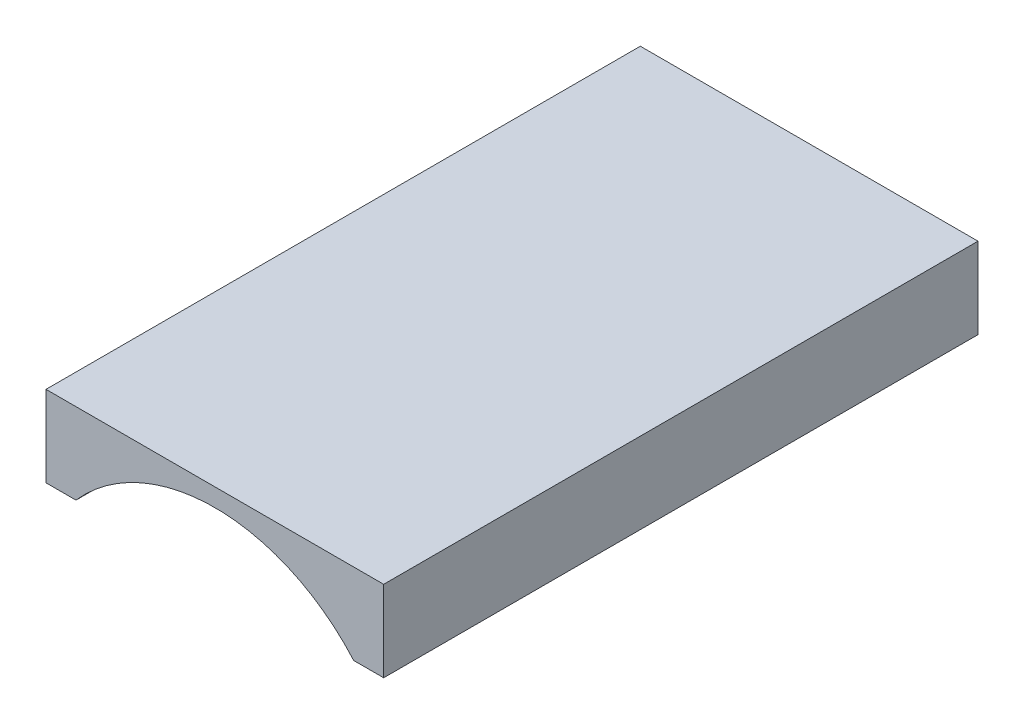
ISO-10303-21;
HEADER;
FILE_DESCRIPTION(('STEP AP214'),'2;1');
FILE_NAME('part.step','',(''),(''),'','','');
FILE_SCHEMA(('AUTOMOTIVE_DESIGN { 1 0 10303 214 1 1 1 1 }'));
ENDSEC;
DATA;
#1=APPLICATION_CONTEXT('core data for automotive mechanical design processes');
#2=APPLICATION_PROTOCOL_DEFINITION('international standard','automotive_design',2000,#1);
#3=PRODUCT_CONTEXT('',#1,'mechanical');
#4=PRODUCT('Part','Part','',(#3));
#5=PRODUCT_RELATED_PRODUCT_CATEGORY('part','',(#4));
#6=PRODUCT_DEFINITION_FORMATION('','',#4);
#7=PRODUCT_DEFINITION_CONTEXT('part definition',#1,'design');
#8=PRODUCT_DEFINITION('design','',#6,#7);
#9=PRODUCT_DEFINITION_SHAPE('','',#8);
#10=(LENGTH_UNIT() NAMED_UNIT(*) SI_UNIT(.MILLI.,.METRE.));
#11=(NAMED_UNIT(*) PLANE_ANGLE_UNIT() SI_UNIT($,.RADIAN.));
#12=(NAMED_UNIT(*) SI_UNIT($,.STERADIAN.) SOLID_ANGLE_UNIT());
#13=UNCERTAINTY_MEASURE_WITH_UNIT(LENGTH_MEASURE(1.E-05),#10,'distance_accuracy_value','');
#14=(GEOMETRIC_REPRESENTATION_CONTEXT(3) GLOBAL_UNCERTAINTY_ASSIGNED_CONTEXT((#13)) GLOBAL_UNIT_ASSIGNED_CONTEXT((#10,
#11,#12)) REPRESENTATION_CONTEXT('',''));
#15=CARTESIAN_POINT('',(0.,0.,0.));
#16=DIRECTION('',(0.,0.,1.));
#17=DIRECTION('',(1.,0.,0.));
#18=AXIS2_PLACEMENT_3D('',#15,#16,#17);
#19=CARTESIAN_POINT('',(42.9347751341225,21.3088495924748,-41.8253043034318));
#20=DIRECTION('',(0.,-1.,0.));
#21=DIRECTION('',(0.,0.,-1.));
#22=AXIS2_PLACEMENT_3D('',#19,#20,#21);
#23=PLANE('',#22);
#24=DIRECTION('',(0.,0.,1.));
#25=VECTOR('',#24,1.);
#26=CARTESIAN_POINT('',(56.6032433394389,21.3088495924748,-39.0500773181584));
#27=LINE('',#26,#25);
#28=CARTESIAN_POINT('',(56.6032433394389,21.3088495924748,-26.4));
#29=VERTEX_POINT('',#28);
#30=CARTESIAN_POINT('',(56.6032433394389,21.3088495924748,0.));
#31=VERTEX_POINT('',#30);
#32=EDGE_CURVE('E133',#29,#31,#27,.T.);
#33=ORIENTED_EDGE('',*,*,#32,.F.);
#34=DIRECTION('',(1.,0.,0.));
#35=VECTOR('',#34,1.);
#36=CARTESIAN_POINT('',(42.9347751341225,21.3088495924748,-26.4));
#37=LINE('',#36,#35);
#38=CARTESIAN_POINT('',(57.9347751341225,21.3088495924748,-26.4));
#39=VERTEX_POINT('',#38);
#40=EDGE_CURVE('E85',#29,#39,#37,.T.);
#41=ORIENTED_EDGE('',*,*,#40,.T.);
#42=DIRECTION('',(0.,0.,1.));
#43=VECTOR('',#42,1.);
#44=CARTESIAN_POINT('',(57.9347751341225,21.3088495924748,-41.8253043034318));
#45=LINE('',#44,#43);
#46=CARTESIAN_POINT('',(57.9347751341225,21.3088495924748,0.));
#47=VERTEX_POINT('',#46);
#48=EDGE_CURVE('E128',#39,#47,#45,.T.);
#49=ORIENTED_EDGE('',*,*,#48,.T.);
#50=DIRECTION('',(1.,0.,0.));
#51=VECTOR('',#50,1.);
#52=CARTESIAN_POINT('',(42.9347751341225,21.3088495924748,0.));
#53=LINE('',#52,#51);
#54=EDGE_CURVE('E112',#31,#47,#53,.T.);
#55=ORIENTED_EDGE('',*,*,#54,.F.);
#56=EDGE_LOOP('',(#33,#41,#49,#55));
#57=FACE_BOUND('',#56,.T.);
#58=ADVANCED_FACE('F34',(#57),#23,.T.);
#59=CARTESIAN_POINT('',(42.9347751341225,7.9,-26.4));
#60=DIRECTION('',(0.,0.,-1.));
#61=DIRECTION('',(-1.,0.,0.));
#62=AXIS2_PLACEMENT_3D('',#59,#60,#61);
#63=PLANE('',#62);
#64=CARTESIAN_POINT('',(50.4347751341225,15.9060725287787,-26.4));
#65=DIRECTION('',(0.,0.,-1.));
#66=DIRECTION('',(-1.,0.,0.));
#67=AXIS2_PLACEMENT_3D('',#64,#65,#66);
#68=CIRCLE('',#67,8.2);
#69=CARTESIAN_POINT('',(44.266306928806,21.3088495924748,-26.4));
#70=VERTEX_POINT('',#69);
#71=EDGE_CURVE('E136',#29,#70,#68,.F.);
#72=ORIENTED_EDGE('',*,*,#71,.T.);
#73=CARTESIAN_POINT('',(42.9347751341225,21.3088495924748,-26.4));
#74=VERTEX_POINT('',#73);
#75=EDGE_CURVE('E77',#74,#70,#37,.T.);
#76=ORIENTED_EDGE('',*,*,#75,.F.);
#77=DIRECTION('',(0.,-1.,0.));
#78=VECTOR('',#77,1.);
#79=CARTESIAN_POINT('',(42.9347751341225,24.9060725287787,-26.4));
#80=LINE('',#79,#78);
#81=CARTESIAN_POINT('',(42.9347751341225,24.9060725287787,-26.4));
#82=VERTEX_POINT('',#81);
#83=EDGE_CURVE('E42',#82,#74,#80,.T.);
#84=ORIENTED_EDGE('',*,*,#83,.F.);
#85=DIRECTION('',(-1.,0.,0.));
#86=VECTOR('',#85,1.);
#87=CARTESIAN_POINT('',(57.9347751341225,24.9060725287787,-26.4));
#88=LINE('',#87,#86);
#89=CARTESIAN_POINT('',(57.9347751341225,24.9060725287787,-26.4));
#90=VERTEX_POINT('',#89);
#91=EDGE_CURVE('E104',#90,#82,#88,.T.);
#92=ORIENTED_EDGE('',*,*,#91,.F.);
#93=DIRECTION('',(0.,1.,0.));
#94=VECTOR('',#93,1.);
#95=CARTESIAN_POINT('',(57.9347751341225,21.3088495924748,-26.4));
#96=LINE('',#95,#94);
#97=EDGE_CURVE('E100',#39,#90,#96,.T.);
#98=ORIENTED_EDGE('',*,*,#97,.F.);
#99=ORIENTED_EDGE('',*,*,#40,.F.);
#100=EDGE_LOOP('',(#72,#76,#84,#92,#98,#99));
#101=FACE_BOUND('',#100,.T.);
#102=ADVANCED_FACE('F36',(#101),#63,.T.);
#103=CARTESIAN_POINT('',(0.,0.,0.));
#104=DIRECTION('',(0.,0.,1.));
#105=DIRECTION('',(1.,0.,0.));
#106=AXIS2_PLACEMENT_3D('',#103,#104,#105);
#107=PLANE('',#106);
#108=CARTESIAN_POINT('',(50.4347751341225,15.9060725287787,0.));
#109=DIRECTION('',(0.,0.,1.));
#110=DIRECTION('',(1.,0.,0.));
#111=AXIS2_PLACEMENT_3D('',#108,#109,#110);
#112=CIRCLE('',#111,8.2);
#113=CARTESIAN_POINT('',(44.266306928806,21.3088495924748,0.));
#114=VERTEX_POINT('',#113);
#115=EDGE_CURVE('E49',#31,#114,#112,.T.);
#116=ORIENTED_EDGE('',*,*,#115,.F.);
#117=ORIENTED_EDGE('',*,*,#54,.T.);
#118=DIRECTION('',(0.,1.,0.));
#119=VECTOR('',#118,1.);
#120=CARTESIAN_POINT('',(57.9347751341225,21.3088495924748,0.));
#121=LINE('',#120,#119);
#122=CARTESIAN_POINT('',(57.9347751341225,24.9060725287787,0.));
#123=VERTEX_POINT('',#122);
#124=EDGE_CURVE('E99',#47,#123,#121,.T.);
#125=ORIENTED_EDGE('',*,*,#124,.T.);
#126=DIRECTION('',(-1.,0.,0.));
#127=VECTOR('',#126,1.);
#128=CARTESIAN_POINT('',(57.9347751341225,24.9060725287787,0.));
#129=LINE('',#128,#127);
#130=CARTESIAN_POINT('',(42.9347751341225,24.9060725287787,0.));
#131=VERTEX_POINT('',#130);
#132=EDGE_CURVE('E110',#123,#131,#129,.T.);
#133=ORIENTED_EDGE('',*,*,#132,.T.);
#134=DIRECTION('',(0.,-1.,0.));
#135=VECTOR('',#134,1.);
#136=CARTESIAN_POINT('',(42.9347751341225,24.9060725287787,0.));
#137=LINE('',#136,#135);
#138=CARTESIAN_POINT('',(42.9347751341225,21.3088495924748,0.));
#139=VERTEX_POINT('',#138);
#140=EDGE_CURVE('E126',#131,#139,#137,.T.);
#141=ORIENTED_EDGE('',*,*,#140,.T.);
#142=EDGE_CURVE('E113',#139,#114,#53,.T.);
#143=ORIENTED_EDGE('',*,*,#142,.T.);
#144=EDGE_LOOP('',(#116,#117,#125,#133,#141,#143));
#145=FACE_BOUND('',#144,.T.);
#146=ADVANCED_FACE('F108',(#145),#107,.T.);
#147=DIRECTION('',(0.,0.,1.));
#148=VECTOR('',#147,1.);
#149=CARTESIAN_POINT('',(44.266306928806,21.3088495924748,-39.0500773181584));
#150=LINE('',#149,#148);
#151=EDGE_CURVE('E121',#70,#114,#150,.T.);
#152=ORIENTED_EDGE('',*,*,#151,.T.);
#153=ORIENTED_EDGE('',*,*,#142,.F.);
#154=DIRECTION('',(0.,0.,1.));
#155=VECTOR('',#154,1.);
#156=CARTESIAN_POINT('',(42.9347751341225,21.3088495924748,-41.8253043034318));
#157=LINE('',#156,#155);
#158=EDGE_CURVE('E11',#74,#139,#157,.T.);
#159=ORIENTED_EDGE('',*,*,#158,.F.);
#160=ORIENTED_EDGE('',*,*,#75,.T.);
#161=EDGE_LOOP('',(#152,#153,#159,#160));
#162=FACE_BOUND('',#161,.T.);
#163=ADVANCED_FACE('F141',(#162),#23,.T.);
#164=CARTESIAN_POINT('',(57.9347751341225,21.3088495924748,-41.8253043034318));
#165=DIRECTION('',(1.,0.,0.));
#166=DIRECTION('',(0.,0.,-1.));
#167=AXIS2_PLACEMENT_3D('',#164,#165,#166);
#168=PLANE('',#167);
#169=ORIENTED_EDGE('',*,*,#48,.F.);
#170=ORIENTED_EDGE('',*,*,#97,.T.);
#171=DIRECTION('',(0.,0.,1.));
#172=VECTOR('',#171,1.);
#173=CARTESIAN_POINT('',(57.9347751341225,24.9060725287787,-41.8253043034318));
#174=LINE('',#173,#172);
#175=EDGE_CURVE('E95',#90,#123,#174,.T.);
#176=ORIENTED_EDGE('',*,*,#175,.T.);
#177=ORIENTED_EDGE('',*,*,#124,.F.);
#178=EDGE_LOOP('',(#169,#170,#176,#177));
#179=FACE_BOUND('',#178,.T.);
#180=ADVANCED_FACE('F98',(#179),#168,.T.);
#181=CARTESIAN_POINT('',(57.9347751341225,24.9060725287787,-41.8253043034318));
#182=DIRECTION('',(0.,1.,0.));
#183=DIRECTION('',(-1.,0.,0.));
#184=AXIS2_PLACEMENT_3D('',#181,#182,#183);
#185=PLANE('',#184);
#186=ORIENTED_EDGE('',*,*,#175,.F.);
#187=ORIENTED_EDGE('',*,*,#91,.T.);
#188=DIRECTION('',(0.,0.,1.));
#189=VECTOR('',#188,1.);
#190=CARTESIAN_POINT('',(42.9347751341225,24.9060725287787,-41.8253043034318));
#191=LINE('',#190,#189);
#192=EDGE_CURVE('E117',#82,#131,#191,.T.);
#193=ORIENTED_EDGE('',*,*,#192,.T.);
#194=ORIENTED_EDGE('',*,*,#132,.F.);
#195=EDGE_LOOP('',(#186,#187,#193,#194));
#196=FACE_BOUND('',#195,.T.);
#197=ADVANCED_FACE('F115',(#196),#185,.T.);
#198=CARTESIAN_POINT('',(42.9347751341225,24.9060725287787,-41.8253043034318));
#199=DIRECTION('',(-1.,0.,0.));
#200=DIRECTION('',(0.,0.,1.));
#201=AXIS2_PLACEMENT_3D('',#198,#199,#200);
#202=PLANE('',#201);
#203=ORIENTED_EDGE('',*,*,#192,.F.);
#204=ORIENTED_EDGE('',*,*,#83,.T.);
#205=ORIENTED_EDGE('',*,*,#158,.T.);
#206=ORIENTED_EDGE('',*,*,#140,.F.);
#207=EDGE_LOOP('',(#203,#204,#205,#206));
#208=FACE_BOUND('',#207,.T.);
#209=ADVANCED_FACE('F142',(#208),#202,.T.);
#210=CARTESIAN_POINT('',(50.4347751341225,15.9060725287787,-39.0500773181584));
#211=DIRECTION('',(0.,0.,1.));
#212=DIRECTION('',(1.,0.,0.));
#213=AXIS2_PLACEMENT_3D('',#210,#211,#212);
#214=CYLINDRICAL_SURFACE('',#213,8.2);
#215=ORIENTED_EDGE('',*,*,#32,.T.);
#216=ORIENTED_EDGE('',*,*,#115,.T.);
#217=ORIENTED_EDGE('',*,*,#151,.F.);
#218=ORIENTED_EDGE('',*,*,#71,.F.);
#219=EDGE_LOOP('',(#215,#216,#217,#218));
#220=FACE_BOUND('',#219,.T.);
#221=ADVANCED_FACE('F137',(#220),#214,.F.);
#222=CLOSED_SHELL('',(#58,#102,#146,#163,#180,#197,#209,#221));
#223=MANIFOLD_SOLID_BREP('B2',#222);
#224=ADVANCED_BREP_SHAPE_REPRESENTATION('',(#18,#223),#14);
#225=SHAPE_DEFINITION_REPRESENTATION(#9,#224);
ENDSEC;
END-ISO-10303-21;
